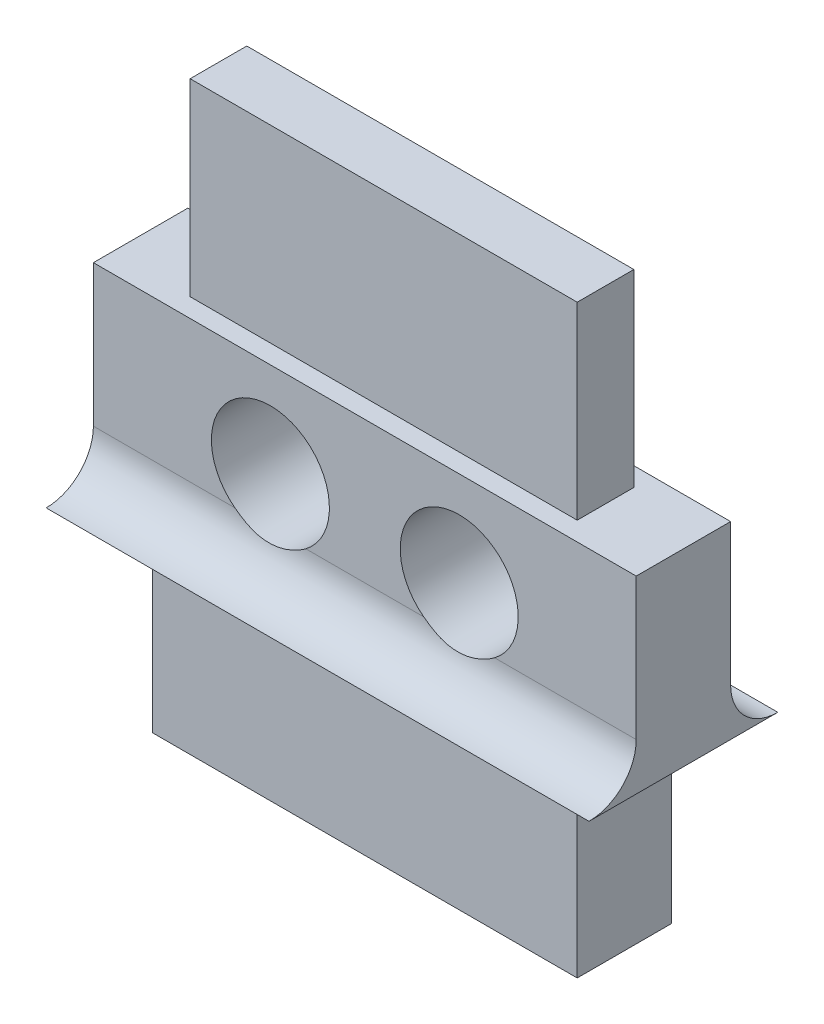
ISO-10303-21;
HEADER;
FILE_DESCRIPTION(('STEP AP214'),'2;1');
FILE_NAME('part.step','',(''),(''),'','','');
FILE_SCHEMA(('AUTOMOTIVE_DESIGN { 1 0 10303 214 1 1 1 1 }'));
ENDSEC;
DATA;
#1=APPLICATION_CONTEXT('core data for automotive mechanical design processes');
#2=APPLICATION_PROTOCOL_DEFINITION('international standard','automotive_design',2000,#1);
#3=PRODUCT_CONTEXT('',#1,'mechanical');
#4=PRODUCT('Part','Part','',(#3));
#5=PRODUCT_RELATED_PRODUCT_CATEGORY('part','',(#4));
#6=PRODUCT_DEFINITION_FORMATION('','',#4);
#7=PRODUCT_DEFINITION_CONTEXT('part definition',#1,'design');
#8=PRODUCT_DEFINITION('design','',#6,#7);
#9=PRODUCT_DEFINITION_SHAPE('','',#8);
#10=(LENGTH_UNIT() NAMED_UNIT(*) SI_UNIT(.MILLI.,.METRE.));
#11=(NAMED_UNIT(*) PLANE_ANGLE_UNIT() SI_UNIT($,.RADIAN.));
#12=(NAMED_UNIT(*) SI_UNIT($,.STERADIAN.) SOLID_ANGLE_UNIT());
#13=UNCERTAINTY_MEASURE_WITH_UNIT(LENGTH_MEASURE(1.E-05),#10,'distance_accuracy_value','');
#14=(GEOMETRIC_REPRESENTATION_CONTEXT(3) GLOBAL_UNCERTAINTY_ASSIGNED_CONTEXT((#13)) GLOBAL_UNIT_ASSIGNED_CONTEXT((#10,
#11,#12)) REPRESENTATION_CONTEXT('',''));
#15=CARTESIAN_POINT('',(0.,0.,0.));
#16=DIRECTION('',(0.,0.,1.));
#17=DIRECTION('',(1.,0.,0.));
#18=AXIS2_PLACEMENT_3D('',#15,#16,#17);
#19=CARTESIAN_POINT('',(0.,0.,0.));
#20=DIRECTION('',(0.,0.,1.));
#21=DIRECTION('',(1.,0.,0.));
#22=AXIS2_PLACEMENT_3D('',#19,#20,#21);
#23=PLANE('',#22);
#24=DIRECTION('',(-1.,0.,0.));
#25=VECTOR('',#24,1.);
#26=CARTESIAN_POINT('',(1.24999999999997,8.00000000000001,0.));
#27=LINE('',#26,#25);
#28=CARTESIAN_POINT('',(11.5007199999999,8.00000000000001,0.));
#29=VERTEX_POINT('',#28);
#30=CARTESIAN_POINT('',(0.,8.00000000000001,0.));
#31=VERTEX_POINT('',#30);
#32=EDGE_CURVE('E301',#29,#31,#27,.T.);
#33=ORIENTED_EDGE('',*,*,#32,.F.);
#34=DIRECTION('',(0.,1.,0.));
#35=VECTOR('',#34,1.);
#36=CARTESIAN_POINT('',(11.5007199999999,8.00000000000001,0.));
#37=LINE('',#36,#35);
#38=CARTESIAN_POINT('',(11.5007199999999,5.,0.));
#39=VERTEX_POINT('',#38);
#40=EDGE_CURVE('E62',#39,#29,#37,.T.);
#41=ORIENTED_EDGE('',*,*,#40,.F.);
#42=DIRECTION('',(-1.,0.,0.));
#43=VECTOR('',#42,1.);
#44=CARTESIAN_POINT('',(12.914933562373,5.,0.));
#45=LINE('',#44,#43);
#46=CARTESIAN_POINT('',(8.50071999999964,5.,0.));
#47=VERTEX_POINT('',#46);
#48=EDGE_CURVE('E236',#39,#47,#45,.T.);
#49=ORIENTED_EDGE('',*,*,#48,.T.);
#50=CARTESIAN_POINT('',(7.75071999999997,6.00000000000023,0.));
#51=DIRECTION('',(0.,0.,1.));
#52=DIRECTION('',(1.,0.,0.));
#53=AXIS2_PLACEMENT_3D('',#50,#51,#52);
#54=CIRCLE('',#53,1.24999999999998);
#55=CARTESIAN_POINT('',(7.00072000000032,5.,0.));
#56=VERTEX_POINT('',#55);
#57=EDGE_CURVE('E267',#47,#56,#54,.T.);
#58=ORIENTED_EDGE('',*,*,#57,.T.);
#59=CARTESIAN_POINT('',(4.49999999999962,5.,0.));
#60=VERTEX_POINT('',#59);
#61=EDGE_CURVE('E241',#56,#60,#45,.T.);
#62=ORIENTED_EDGE('',*,*,#61,.T.);
#63=CARTESIAN_POINT('',(3.74999999999997,6.00000000000023,0.));
#64=DIRECTION('',(0.,0.,1.));
#65=DIRECTION('',(1.,0.,0.));
#66=AXIS2_PLACEMENT_3D('',#63,#64,#65);
#67=CIRCLE('',#66,1.24999999999997);
#68=CARTESIAN_POINT('',(3.00000000000032,5.,0.));
#69=VERTEX_POINT('',#68);
#70=EDGE_CURVE('E263',#60,#69,#67,.T.);
#71=ORIENTED_EDGE('',*,*,#70,.T.);
#72=CARTESIAN_POINT('',(0.,5.,0.));
#73=VERTEX_POINT('',#72);
#74=EDGE_CURVE('E242',#69,#73,#45,.T.);
#75=ORIENTED_EDGE('',*,*,#74,.T.);
#76=DIRECTION('',(0.,-1.,0.));
#77=VECTOR('',#76,1.);
#78=CARTESIAN_POINT('',(0.,8.00000000000001,0.));
#79=LINE('',#78,#77);
#80=EDGE_CURVE('E280',#31,#73,#79,.T.);
#81=ORIENTED_EDGE('',*,*,#80,.F.);
#82=EDGE_LOOP('',(#33,#41,#49,#58,#62,#71,#75,#81));
#83=FACE_BOUND('',#82,.T.);
#84=ADVANCED_FACE('F34',(#83),#23,.F.);
#85=CARTESIAN_POINT('',(0.,0.,2.));
#86=DIRECTION('',(0.,0.,1.));
#87=DIRECTION('',(1.,0.,0.));
#88=AXIS2_PLACEMENT_3D('',#85,#86,#87);
#89=PLANE('',#88);
#90=DIRECTION('',(-1.,0.,0.));
#91=VECTOR('',#90,1.);
#92=CARTESIAN_POINT('',(10.25072,8.00000000000001,2.));
#93=LINE('',#92,#91);
#94=CARTESIAN_POINT('',(11.5007199999999,8.00000000000001,2.));
#95=VERTEX_POINT('',#94);
#96=CARTESIAN_POINT('',(0.,8.00000000000001,2.));
#97=VERTEX_POINT('',#96);
#98=EDGE_CURVE('E287',#95,#97,#93,.T.);
#99=ORIENTED_EDGE('',*,*,#98,.T.);
#100=DIRECTION('',(0.,-1.,0.));
#101=VECTOR('',#100,1.);
#102=CARTESIAN_POINT('',(0.,8.00000000000001,2.));
#103=LINE('',#102,#101);
#104=CARTESIAN_POINT('',(0.,5.,2.));
#105=VERTEX_POINT('',#104);
#106=EDGE_CURVE('E289',#97,#105,#103,.T.);
#107=ORIENTED_EDGE('',*,*,#106,.T.);
#108=DIRECTION('',(-1.,0.,0.));
#109=VECTOR('',#108,1.);
#110=CARTESIAN_POINT('',(12.914933562373,5.,2.));
#111=LINE('',#110,#109);
#112=CARTESIAN_POINT('',(3.00000000000032,5.,2.));
#113=VERTEX_POINT('',#112);
#114=EDGE_CURVE('E258',#113,#105,#111,.T.);
#115=ORIENTED_EDGE('',*,*,#114,.F.);
#116=CARTESIAN_POINT('',(3.74999999999997,6.00000000000023,2.));
#117=DIRECTION('',(0.,0.,1.));
#118=DIRECTION('',(1.,0.,0.));
#119=AXIS2_PLACEMENT_3D('',#116,#117,#118);
#120=CIRCLE('',#119,1.24999999999997);
#121=CARTESIAN_POINT('',(4.49999999999962,5.,2.));
#122=VERTEX_POINT('',#121);
#123=EDGE_CURVE('E264',#122,#113,#120,.T.);
#124=ORIENTED_EDGE('',*,*,#123,.F.);
#125=CARTESIAN_POINT('',(7.00072000000031,5.,2.));
#126=VERTEX_POINT('',#125);
#127=EDGE_CURVE('E257',#126,#122,#111,.T.);
#128=ORIENTED_EDGE('',*,*,#127,.F.);
#129=CARTESIAN_POINT('',(7.75071999999997,6.00000000000023,2.));
#130=DIRECTION('',(0.,0.,1.));
#131=DIRECTION('',(1.,0.,0.));
#132=AXIS2_PLACEMENT_3D('',#129,#130,#131);
#133=CIRCLE('',#132,1.24999999999998);
#134=CARTESIAN_POINT('',(8.50071999999963,5.,2.));
#135=VERTEX_POINT('',#134);
#136=EDGE_CURVE('E270',#135,#126,#133,.T.);
#137=ORIENTED_EDGE('',*,*,#136,.F.);
#138=CARTESIAN_POINT('',(11.5007199999999,5.,2.));
#139=VERTEX_POINT('',#138);
#140=EDGE_CURVE('E254',#139,#135,#111,.T.);
#141=ORIENTED_EDGE('',*,*,#140,.F.);
#142=DIRECTION('',(0.,1.,0.));
#143=VECTOR('',#142,1.);
#144=CARTESIAN_POINT('',(11.5007199999999,8.00000000000001,2.));
#145=LINE('',#144,#143);
#146=EDGE_CURVE('E285',#139,#95,#145,.T.);
#147=ORIENTED_EDGE('',*,*,#146,.T.);
#148=EDGE_LOOP('',(#99,#107,#115,#124,#128,#137,#141,#147));
#149=FACE_BOUND('',#148,.T.);
#150=ADVANCED_FACE('F343',(#149),#89,.T.);
#151=DIRECTION('',(-1.,0.,0.));
#152=VECTOR('',#151,1.);
#153=CARTESIAN_POINT('',(12.914933562373,4.,2.));
#154=LINE('',#153,#152);
#155=CARTESIAN_POINT('',(10.25072,4.,2.));
#156=VERTEX_POINT('',#155);
#157=CARTESIAN_POINT('',(1.24999999999997,4.,2.));
#158=VERTEX_POINT('',#157);
#159=EDGE_CURVE('E251',#156,#158,#154,.T.);
#160=ORIENTED_EDGE('',*,*,#159,.T.);
#161=DIRECTION('',(0.,-1.,0.));
#162=VECTOR('',#161,1.);
#163=CARTESIAN_POINT('',(1.24999999999997,4.,2.));
#164=LINE('',#163,#162);
#165=CARTESIAN_POINT('',(1.24999999999997,0.,2.));
#166=VERTEX_POINT('',#165);
#167=EDGE_CURVE('E276',#158,#166,#164,.T.);
#168=ORIENTED_EDGE('',*,*,#167,.T.);
#169=DIRECTION('',(1.,0.,0.));
#170=VECTOR('',#169,1.);
#171=CARTESIAN_POINT('',(1.24999999999997,0.,2.));
#172=LINE('',#171,#170);
#173=CARTESIAN_POINT('',(10.25072,0.,2.));
#174=VERTEX_POINT('',#173);
#175=EDGE_CURVE('E279',#166,#174,#172,.T.);
#176=ORIENTED_EDGE('',*,*,#175,.T.);
#177=DIRECTION('',(0.,1.,0.));
#178=VECTOR('',#177,1.);
#179=CARTESIAN_POINT('',(10.25072,4.,2.));
#180=LINE('',#179,#178);
#181=EDGE_CURVE('E282',#174,#156,#180,.T.);
#182=ORIENTED_EDGE('',*,*,#181,.T.);
#183=EDGE_LOOP('',(#160,#168,#176,#182));
#184=FACE_BOUND('',#183,.T.);
#185=ADVANCED_FACE('F341',(#184),#89,.T.);
#186=DIRECTION('',(0.,-1.,0.));
#187=VECTOR('',#186,1.);
#188=CARTESIAN_POINT('',(1.24999999999997,4.,0.));
#189=LINE('',#188,#187);
#190=CARTESIAN_POINT('',(1.24999999999997,4.,0.));
#191=VERTEX_POINT('',#190);
#192=CARTESIAN_POINT('',(1.24999999999997,0.,0.));
#193=VERTEX_POINT('',#192);
#194=EDGE_CURVE('E273',#191,#193,#189,.T.);
#195=ORIENTED_EDGE('',*,*,#194,.F.);
#196=DIRECTION('',(-1.,0.,0.));
#197=VECTOR('',#196,1.);
#198=CARTESIAN_POINT('',(12.914933562373,4.,0.));
#199=LINE('',#198,#197);
#200=CARTESIAN_POINT('',(10.25072,4.,0.));
#201=VERTEX_POINT('',#200);
#202=EDGE_CURVE('E243',#201,#191,#199,.T.);
#203=ORIENTED_EDGE('',*,*,#202,.F.);
#204=DIRECTION('',(0.,1.,0.));
#205=VECTOR('',#204,1.);
#206=CARTESIAN_POINT('',(10.25072,4.,0.));
#207=LINE('',#206,#205);
#208=CARTESIAN_POINT('',(10.25072,0.,0.));
#209=VERTEX_POINT('',#208);
#210=EDGE_CURVE('E297',#209,#201,#207,.T.);
#211=ORIENTED_EDGE('',*,*,#210,.F.);
#212=DIRECTION('',(1.,0.,0.));
#213=VECTOR('',#212,1.);
#214=CARTESIAN_POINT('',(1.24999999999997,0.,0.));
#215=LINE('',#214,#213);
#216=EDGE_CURVE('E295',#193,#209,#215,.T.);
#217=ORIENTED_EDGE('',*,*,#216,.F.);
#218=EDGE_LOOP('',(#195,#203,#211,#217));
#219=FACE_BOUND('',#218,.T.);
#220=ADVANCED_FACE('F331',(#219),#23,.F.);
#221=CARTESIAN_POINT('',(1.24999999999997,4.,2.));
#222=DIRECTION('',(1.,0.,0.));
#223=DIRECTION('',(0.,1.,0.));
#224=AXIS2_PLACEMENT_3D('',#221,#222,#223);
#225=PLANE('',#224);
#226=ORIENTED_EDGE('',*,*,#194,.T.);
#227=DIRECTION('',(0.,0.,-1.));
#228=VECTOR('',#227,1.);
#229=CARTESIAN_POINT('',(1.24999999999997,0.,2.));
#230=LINE('',#229,#228);
#231=EDGE_CURVE('E47',#166,#193,#230,.T.);
#232=ORIENTED_EDGE('',*,*,#231,.F.);
#233=ORIENTED_EDGE('',*,*,#167,.F.);
#234=DIRECTION('',(0.,0.,-1.));
#235=VECTOR('',#234,1.);
#236=CARTESIAN_POINT('',(1.24999999999997,4.,2.));
#237=LINE('',#236,#235);
#238=EDGE_CURVE('E292',#158,#191,#237,.T.);
#239=ORIENTED_EDGE('',*,*,#238,.T.);
#240=EDGE_LOOP('',(#226,#232,#233,#239));
#241=FACE_BOUND('',#240,.T.);
#242=ADVANCED_FACE('F36',(#241),#225,.F.);
#243=CARTESIAN_POINT('',(1.24999999999997,0.,2.));
#244=DIRECTION('',(0.,1.,0.));
#245=DIRECTION('',(-1.,0.,0.));
#246=AXIS2_PLACEMENT_3D('',#243,#244,#245);
#247=PLANE('',#246);
#248=ORIENTED_EDGE('',*,*,#216,.T.);
#249=DIRECTION('',(0.,0.,-1.));
#250=VECTOR('',#249,1.);
#251=CARTESIAN_POINT('',(10.25072,0.,2.));
#252=LINE('',#251,#250);
#253=EDGE_CURVE('E319',#174,#209,#252,.T.);
#254=ORIENTED_EDGE('',*,*,#253,.F.);
#255=ORIENTED_EDGE('',*,*,#175,.F.);
#256=ORIENTED_EDGE('',*,*,#231,.T.);
#257=EDGE_LOOP('',(#248,#254,#255,#256));
#258=FACE_BOUND('',#257,.T.);
#259=ADVANCED_FACE('F324',(#258),#247,.F.);
#260=CARTESIAN_POINT('',(10.25072,4.,2.));
#261=DIRECTION('',(-1.,0.,0.));
#262=DIRECTION('',(0.,-1.,0.));
#263=AXIS2_PLACEMENT_3D('',#260,#261,#262);
#264=PLANE('',#263);
#265=ORIENTED_EDGE('',*,*,#210,.T.);
#266=DIRECTION('',(0.,0.,-1.));
#267=VECTOR('',#266,1.);
#268=CARTESIAN_POINT('',(10.25072,4.,2.));
#269=LINE('',#268,#267);
#270=EDGE_CURVE('E316',#156,#201,#269,.T.);
#271=ORIENTED_EDGE('',*,*,#270,.F.);
#272=ORIENTED_EDGE('',*,*,#181,.F.);
#273=ORIENTED_EDGE('',*,*,#253,.T.);
#274=EDGE_LOOP('',(#265,#271,#272,#273));
#275=FACE_BOUND('',#274,.T.);
#276=ADVANCED_FACE('F339',(#275),#264,.F.);
#277=CARTESIAN_POINT('',(11.5007199999999,8.00000000000001,2.));
#278=DIRECTION('',(-1.,0.,0.));
#279=DIRECTION('',(0.,0.,1.));
#280=AXIS2_PLACEMENT_3D('',#277,#278,#279);
#281=PLANE('',#280);
#282=DIRECTION('',(0.,0.,-1.));
#283=VECTOR('',#282,1.);
#284=CARTESIAN_POINT('',(11.5007199999999,4.,2.));
#285=LINE('',#284,#283);
#286=CARTESIAN_POINT('',(11.5007199999999,4.,3.));
#287=VERTEX_POINT('',#286);
#288=CARTESIAN_POINT('',(11.5007199999999,4.,-1.));
#289=VERTEX_POINT('',#288);
#290=EDGE_CURVE('E314',#287,#289,#285,.T.);
#291=ORIENTED_EDGE('',*,*,#290,.T.);
#292=CARTESIAN_POINT('',(11.5007199999999,5.,-1.));
#293=DIRECTION('',(-1.,0.,0.));
#294=DIRECTION('',(0.,0.,1.));
#295=AXIS2_PLACEMENT_3D('',#292,#293,#294);
#296=CIRCLE('',#295,1.);
#297=EDGE_CURVE('E233',#289,#39,#296,.T.);
#298=ORIENTED_EDGE('',*,*,#297,.T.);
#299=ORIENTED_EDGE('',*,*,#40,.T.);
#300=DIRECTION('',(0.,0.,-1.));
#301=VECTOR('',#300,1.);
#302=CARTESIAN_POINT('',(11.5007199999999,8.00000000000001,2.));
#303=LINE('',#302,#301);
#304=EDGE_CURVE('E311',#95,#29,#303,.T.);
#305=ORIENTED_EDGE('',*,*,#304,.F.);
#306=ORIENTED_EDGE('',*,*,#146,.F.);
#307=CARTESIAN_POINT('',(11.5007199999999,5.,3.));
#308=DIRECTION('',(-1.,0.,0.));
#309=DIRECTION('',(0.,0.,1.));
#310=AXIS2_PLACEMENT_3D('',#307,#308,#309);
#311=CIRCLE('',#310,1.);
#312=EDGE_CURVE('E253',#139,#287,#311,.T.);
#313=ORIENTED_EDGE('',*,*,#312,.T.);
#314=EDGE_LOOP('',(#291,#298,#299,#305,#306,#313));
#315=FACE_BOUND('',#314,.T.);
#316=ADVANCED_FACE('F367',(#315),#281,.F.);
#317=CARTESIAN_POINT('',(1.24999999999997,8.00000000000001,2.));
#318=DIRECTION('',(0.,-1.,0.));
#319=DIRECTION('',(0.,0.,-1.));
#320=AXIS2_PLACEMENT_3D('',#317,#318,#319);
#321=PLANE('',#320);
#322=ORIENTED_EDGE('',*,*,#32,.T.);
#323=DIRECTION('',(0.,0.,-1.));
#324=VECTOR('',#323,1.);
#325=CARTESIAN_POINT('',(0.,8.00000000000001,2.));
#326=LINE('',#325,#324);
#327=EDGE_CURVE('E308',#97,#31,#326,.T.);
#328=ORIENTED_EDGE('',*,*,#327,.F.);
#329=ORIENTED_EDGE('',*,*,#98,.F.);
#330=ORIENTED_EDGE('',*,*,#304,.T.);
#331=EDGE_LOOP('',(#322,#328,#329,#330));
#332=FACE_BOUND('',#331,.T.);
#333=DIRECTION('',(0.,0.,-1.));
#334=VECTOR('',#333,1.);
#335=CARTESIAN_POINT('',(9.85071999999997,8.00000000000001,0.4));
#336=LINE('',#335,#334);
#337=CARTESIAN_POINT('',(9.85071999999997,8.00000000000001,1.6));
#338=VERTEX_POINT('',#337);
#339=CARTESIAN_POINT('',(9.85071999999997,8.00000000000001,0.4));
#340=VERTEX_POINT('',#339);
#341=EDGE_CURVE('E182',#338,#340,#336,.T.);
#342=ORIENTED_EDGE('',*,*,#341,.F.);
#343=DIRECTION('',(1.,0.,0.));
#344=VECTOR('',#343,1.);
#345=CARTESIAN_POINT('',(9.85071999999997,8.00000000000001,1.6));
#346=LINE('',#345,#344);
#347=CARTESIAN_POINT('',(1.64999999999997,8.00000000000001,1.6));
#348=VERTEX_POINT('',#347);
#349=EDGE_CURVE('E176',#348,#338,#346,.T.);
#350=ORIENTED_EDGE('',*,*,#349,.F.);
#351=DIRECTION('',(0.,0.,1.));
#352=VECTOR('',#351,1.);
#353=CARTESIAN_POINT('',(1.64999999999997,8.00000000000001,0.400000000000001));
#354=LINE('',#353,#352);
#355=CARTESIAN_POINT('',(1.64999999999997,8.00000000000001,0.400000000000001));
#356=VERTEX_POINT('',#355);
#357=EDGE_CURVE('E185',#356,#348,#354,.T.);
#358=ORIENTED_EDGE('',*,*,#357,.F.);
#359=DIRECTION('',(-1.,0.,0.));
#360=VECTOR('',#359,1.);
#361=CARTESIAN_POINT('',(9.85071999999997,8.00000000000001,0.4));
#362=LINE('',#361,#360);
#363=EDGE_CURVE('E168',#340,#356,#362,.T.);
#364=ORIENTED_EDGE('',*,*,#363,.F.);
#365=EDGE_LOOP('',(#342,#350,#358,#364));
#366=FACE_BOUND('',#365,.T.);
#367=ADVANCED_FACE('F180',(#332,#366),#321,.F.);
#368=CARTESIAN_POINT('',(0.,8.00000000000001,2.));
#369=DIRECTION('',(1.,0.,0.));
#370=DIRECTION('',(0.,1.,0.));
#371=AXIS2_PLACEMENT_3D('',#368,#369,#370);
#372=PLANE('',#371);
#373=ORIENTED_EDGE('',*,*,#80,.T.);
#374=CARTESIAN_POINT('',(0.,5.,-1.));
#375=DIRECTION('',(1.,0.,0.));
#376=DIRECTION('',(0.,1.,0.));
#377=AXIS2_PLACEMENT_3D('',#374,#375,#376);
#378=CIRCLE('',#377,1.);
#379=CARTESIAN_POINT('',(0.,4.,-1.));
#380=VERTEX_POINT('',#379);
#381=EDGE_CURVE('E232',#73,#380,#378,.T.);
#382=ORIENTED_EDGE('',*,*,#381,.T.);
#383=DIRECTION('',(0.,0.,-1.));
#384=VECTOR('',#383,1.);
#385=CARTESIAN_POINT('',(0.,4.,2.));
#386=LINE('',#385,#384);
#387=CARTESIAN_POINT('',(0.,4.,3.));
#388=VERTEX_POINT('',#387);
#389=EDGE_CURVE('E306',#388,#380,#386,.T.);
#390=ORIENTED_EDGE('',*,*,#389,.F.);
#391=CARTESIAN_POINT('',(0.,5.,3.));
#392=DIRECTION('',(1.,0.,0.));
#393=DIRECTION('',(0.,-1.,0.));
#394=AXIS2_PLACEMENT_3D('',#391,#392,#393);
#395=CIRCLE('',#394,1.);
#396=EDGE_CURVE('E235',#388,#105,#395,.T.);
#397=ORIENTED_EDGE('',*,*,#396,.T.);
#398=ORIENTED_EDGE('',*,*,#106,.F.);
#399=ORIENTED_EDGE('',*,*,#327,.T.);
#400=EDGE_LOOP('',(#373,#382,#390,#397,#398,#399));
#401=FACE_BOUND('',#400,.T.);
#402=ADVANCED_FACE('F361',(#401),#372,.F.);
#403=CARTESIAN_POINT('',(1.24999999999997,4.,2.));
#404=DIRECTION('',(0.,1.,0.));
#405=DIRECTION('',(0.,0.,1.));
#406=AXIS2_PLACEMENT_3D('',#403,#404,#405);
#407=PLANE('',#406);
#408=ORIENTED_EDGE('',*,*,#202,.T.);
#409=ORIENTED_EDGE('',*,*,#238,.F.);
#410=ORIENTED_EDGE('',*,*,#159,.F.);
#411=ORIENTED_EDGE('',*,*,#270,.T.);
#412=EDGE_LOOP('',(#408,#409,#410,#411));
#413=FACE_BOUND('',#412,.T.);
#414=ORIENTED_EDGE('',*,*,#389,.T.);
#415=DIRECTION('',(-1.,0.,0.));
#416=VECTOR('',#415,1.);
#417=CARTESIAN_POINT('',(12.914933562373,4.,-1.));
#418=LINE('',#417,#416);
#419=EDGE_CURVE('E239',#289,#380,#418,.T.);
#420=ORIENTED_EDGE('',*,*,#419,.F.);
#421=ORIENTED_EDGE('',*,*,#290,.F.);
#422=DIRECTION('',(-1.,0.,0.));
#423=VECTOR('',#422,1.);
#424=CARTESIAN_POINT('',(12.914933562373,4.,3.));
#425=LINE('',#424,#423);
#426=EDGE_CURVE('E250',#287,#388,#425,.T.);
#427=ORIENTED_EDGE('',*,*,#426,.T.);
#428=EDGE_LOOP('',(#414,#420,#421,#427));
#429=FACE_BOUND('',#428,.T.);
#430=ADVANCED_FACE('F334',(#413,#429),#407,.F.);
#431=CARTESIAN_POINT('',(7.75071999999997,6.00000000000023,2.));
#432=DIRECTION('',(0.,0.,-1.));
#433=DIRECTION('',(-1.,0.,0.));
#434=AXIS2_PLACEMENT_3D('',#431,#432,#433);
#435=CYLINDRICAL_SURFACE('',#434,1.24999999999998);
#436=ORIENTED_EDGE('',*,*,#136,.T.);
#437=CARTESIAN_POINT('',(6.50072,6.,3.));
#438=CARTESIAN_POINT('',(6.50072532169146,5.99999978361962,2.97204992704358));
#439=CARTESIAN_POINT('',(6.50071939610446,5.99882745440819,2.9441131972668));
#440=CARTESIAN_POINT('',(6.50073046598745,5.99415030073656,2.88843631015914));
#441=CARTESIAN_POINT('',(6.50074746097995,5.99064552486542,2.86069614874554));
#442=CARTESIAN_POINT('',(6.50090094022251,5.97665054069726,2.77802649176053));
#443=CARTESIAN_POINT('',(6.50113990971723,5.96267967333993,2.72364483905864));
#444=CARTESIAN_POINT('',(6.50278662214765,5.92584624654431,2.61797088191552));
#445=CARTESIAN_POINT('',(6.50419535772504,5.90297614414265,2.5666812409598));
#446=CARTESIAN_POINT('',(6.50957283886306,5.84905409519246,2.46875147393668));
#447=CARTESIAN_POINT('',(6.51353998426913,5.81800726994184,2.422108462677));
#448=CARTESIAN_POINT('',(6.52554707147617,5.74976709316367,2.33608412192638));
#449=CARTESIAN_POINT('',(6.53347946503019,5.71275267904168,2.2965466821992));
#450=CARTESIAN_POINT('',(6.55488696571303,5.6337368256466,2.2246138986495));
#451=CARTESIAN_POINT('',(6.5683566501472,5.59174029392989,2.19221161487647));
#452=CARTESIAN_POINT('',(6.60033915577241,5.50919134506977,2.13806611689877));
#453=CARTESIAN_POINT('',(6.61825588390264,5.46887683924685,2.11560544227966));
#454=CARTESIAN_POINT('',(6.65980351938817,5.38806641572971,2.07728408580201));
#455=CARTESIAN_POINT('',(6.68343424400287,5.34757050387771,2.0614231929185));
#456=CARTESIAN_POINT('',(6.73523659665331,5.2696514541779,2.03619966154708));
#457=CARTESIAN_POINT('',(6.76322393193426,5.23217052849071,2.02663214527757));
#458=CARTESIAN_POINT('',(6.82374194947047,5.16010161782889,2.0122144777549));
#459=CARTESIAN_POINT('',(6.856274290725,5.12551469661602,2.00736605421709));
#460=CARTESIAN_POINT('',(6.92945872859267,5.05613898673155,2.0008963891932));
#461=CARTESIAN_POINT('',(6.9706172919172,5.02184368283418,1.99974280360213));
#462=CARTESIAN_POINT('',(7.05697101598225,4.95880959112038,2.00035077178162));
#463=CARTESIAN_POINT('',(7.10216939804423,4.93007529644919,2.00211467190863));
#464=CARTESIAN_POINT('',(7.20524370870765,4.87346978488139,2.00755027815467));
#465=CARTESIAN_POINT('',(7.26384075093854,4.84693522897629,2.01153441073528));
#466=CARTESIAN_POINT('',(7.38442418322838,4.80315151527515,2.01931330599981));
#467=CARTESIAN_POINT('',(7.44641164051076,4.78590529997748,2.02310800832818));
#468=CARTESIAN_POINT('',(7.57842588452386,4.75993775182277,2.02913832605215));
#469=CARTESIAN_POINT('',(7.64865574404498,4.75218578355409,2.03119083642386));
#470=CARTESIAN_POINT('',(7.78942421870189,4.74861724429449,2.03211032718628));
#471=CARTESIAN_POINT('',(7.8599627717348,4.7527983737185,2.03097792133153));
#472=CARTESIAN_POINT('',(7.99719495889271,4.77263724561326,2.02614044681261));
#473=CARTESIAN_POINT('',(8.063940750725,4.78795762791373,2.02251116782302));
#474=CARTESIAN_POINT('',(8.19406539328195,4.82926926560037,2.0144593500494));
#475=CARTESIAN_POINT('',(8.25744046850784,4.85527221346863,2.0100359450599));
#476=CARTESIAN_POINT('',(8.38102967718007,4.91825821224949,2.0028273129751));
#477=CARTESIAN_POINT('',(8.44109165479262,4.9555476557265,2.00009529153889));
#478=CARTESIAN_POINT('',(8.55403621794822,5.0397337462953,1.99991026215672));
#479=CARTESIAN_POINT('',(8.60693400316511,5.08660950679127,2.00244588528641));
#480=CARTESIAN_POINT('',(8.69017928767852,5.17387180734177,2.01453855024301));
#481=CARTESIAN_POINT('',(8.72271722033839,5.212467219141,2.02195960479528));
#482=CARTESIAN_POINT('',(8.78224679651315,5.29224299954566,2.0427710050816));
#483=CARTESIAN_POINT('',(8.80924376580793,5.33342083582994,2.05615557927127));
#484=CARTESIAN_POINT('',(8.85733112585975,5.41670278630373,2.08984480805756));
#485=CARTESIAN_POINT('',(8.8783937406162,5.4588102931143,2.11018104988533));
#486=CARTESIAN_POINT('',(8.91449184072981,5.54155119806155,2.15797690000796));
#487=CARTESIAN_POINT('',(8.92952668708271,5.58218443949619,2.18543726302353));
#488=CARTESIAN_POINT('',(8.95335054186465,5.65704979983648,2.24475039840749));
#489=CARTESIAN_POINT('',(8.96251286282049,5.69153236049709,2.27614137822856));
#490=CARTESIAN_POINT('',(8.9771443623878,5.75611198943674,2.34388549282698));
#491=CARTESIAN_POINT('',(8.9826129359274,5.78620833857858,2.38023943941481));
#492=CARTESIAN_POINT('',(8.99112313416134,5.84263813582409,2.45921483165553));
#493=CARTESIAN_POINT('',(8.99400887923185,5.86865984337178,2.50207525475577));
#494=CARTESIAN_POINT('',(8.99796868948614,5.91403249458111,2.59127815841558));
#495=CARTESIAN_POINT('',(8.99904163383959,5.93337930536606,2.63762277472509));
#496=CARTESIAN_POINT('',(9.00037107652992,5.96595332765261,2.73584249898936));
#497=CARTESIAN_POINT('',(9.00056947887205,5.97869656184542,2.78788101534216));
#498=CARTESIAN_POINT('',(9.00069708521,5.99146460992094,2.8669085241022));
#499=CARTESIAN_POINT('',(9.00071126209137,5.99466283273372,2.89342243079684));
#500=CARTESIAN_POINT('',(9.00072052862289,5.99893031356652,2.94662017774424));
#501=CARTESIAN_POINT('',(9.00071561890911,5.99999964253087,2.97330401230451));
#502=CARTESIAN_POINT('',(9.00071999999995,6.,3.));
#503=B_SPLINE_CURVE_WITH_KNOTS('',3,(#437,#438,#439,#440,#441,#442,#443,#444,#445,#446,#447,
#448,#449,#450,#451,#452,#453,#454,#455,#456,#457,#458,#459,#460,#461,#462,#463,#464,#465,#466,
#467,#468,#469,#470,#471,#472,#473,#474,#475,#476,#477,#478,#479,#480,#481,#482,#483,#484,#485,
#486,#487,#488,#489,#490,#491,#492,#493,#494,#495,#496,#497,#498,#499,#500,#501,#502),
.UNSPECIFIED.,.F.,.F.,(4,2,2,2,2,2,2,2,2,2,2,2,2,2,2,2,2,2,2,2,2,2,2,2,2,2,2,2,2,2,2,2,4),(0.,
0.0837991264591867,0.167596507286032,0.335182428328774,0.502910705164787,0.670534178146347,
0.83383965075248,0.996985577091702,1.1447307915601,1.2924712815802,1.4351265755665,
1.57783407771075,1.73800933032284,1.898313464803,2.09086826397854,2.2834840276932,
2.49446115488416,2.70539762816395,2.91019854784175,3.11522422983577,3.32640921793773,
3.53713888837388,3.6895840208512,3.84188193504676,3.99488127288407,4.14789682590834,
4.2898369515479,4.43180032273025,4.58184518650066,4.73198278709179,4.89195684490057,
4.97200189248414,5.05204427256112),.UNSPECIFIED.);
#504=EDGE_CURVE('E201',#126,#135,#503,.T.);
#505=ORIENTED_EDGE('',*,*,#504,.T.);
#506=EDGE_LOOP('',(#436,#505));
#507=FACE_BOUND('',#506,.T.);
#508=ORIENTED_EDGE('',*,*,#57,.F.);
#509=CARTESIAN_POINT('',(9.00071999999995,6.00000000000023,-1.));
#510=CARTESIAN_POINT('',(9.0007146783085,5.9999997836197,-0.972049927043585));
#511=CARTESIAN_POINT('',(9.00072060389549,5.99882745440822,-0.944113197266816));
#512=CARTESIAN_POINT('',(9.00070953401251,5.99415030073654,-0.888436310159157));
#513=CARTESIAN_POINT('',(9.00069253902,5.99064552486541,-0.860696148745559));
#514=CARTESIAN_POINT('',(9.00053905977744,5.97665054069728,-0.778026491760542));
#515=CARTESIAN_POINT('',(9.00030009028272,5.96267967333993,-0.723644839058651));
#516=CARTESIAN_POINT('',(8.99865337785231,5.92584624654431,-0.617970881915522));
#517=CARTESIAN_POINT('',(8.99724464227491,5.90297614414265,-0.566681240959797));
#518=CARTESIAN_POINT('',(8.99186716113689,5.84905409519246,-0.46875147393668));
#519=CARTESIAN_POINT('',(8.98790001573082,5.81800726994184,-0.422108462677004));
#520=CARTESIAN_POINT('',(8.97589292852379,5.74976709316367,-0.336084121926386));
#521=CARTESIAN_POINT('',(8.96796053496976,5.71275267904169,-0.296546682199207));
#522=CARTESIAN_POINT('',(8.94655303428693,5.6337368256466,-0.2246138986495));
#523=CARTESIAN_POINT('',(8.93308334985275,5.5917402939299,-0.192211614876471));
#524=CARTESIAN_POINT('',(8.90110084422754,5.50919134506978,-0.138066116898775));
#525=CARTESIAN_POINT('',(8.88318411609732,5.46887683924686,-0.115605442279658));
#526=CARTESIAN_POINT('',(8.84163648061178,5.38806641572971,-0.0772840858020151));
#527=CARTESIAN_POINT('',(8.81800575599709,5.34757050387772,-0.0614231929185052));
#528=CARTESIAN_POINT('',(8.76620340334664,5.26965145417791,-0.0361996615470828));
#529=CARTESIAN_POINT('',(8.7382160680657,5.23217052849072,-0.0266321452775715));
#530=CARTESIAN_POINT('',(8.67769805052948,5.16010161782889,-0.0122144777548965));
#531=CARTESIAN_POINT('',(8.64516570927496,5.12551469661603,-0.00736605421709508));
#532=CARTESIAN_POINT('',(8.57198127140729,5.05613898673155,-0.000896389193199293));
#533=CARTESIAN_POINT('',(8.53082270808275,5.02184368283418,0.000257196397874055));
#534=CARTESIAN_POINT('',(8.4444689840177,4.95880959112039,-0.000350771781617829));
#535=CARTESIAN_POINT('',(8.39927060195573,4.9300752964492,-0.00211467190862638));
#536=CARTESIAN_POINT('',(8.29619629129231,4.87346978488139,-0.00755027815466965));
#537=CARTESIAN_POINT('',(8.23759924906142,4.84693522897629,-0.0115344107352799));
#538=CARTESIAN_POINT('',(8.11701581677158,4.80315151527515,-0.0193133059998094));
#539=CARTESIAN_POINT('',(8.05502835948919,4.78590529997748,-0.0231080083281837));
#540=CARTESIAN_POINT('',(7.9230141154761,4.75993775182277,-0.0291383260521484));
#541=CARTESIAN_POINT('',(7.85278425595498,4.75218578355409,-0.0311908364238647));
#542=CARTESIAN_POINT('',(7.71201578129807,4.74861724429449,-0.032110327186275));
#543=CARTESIAN_POINT('',(7.64147722826516,4.7527983737185,-0.0309779213315299));
#544=CARTESIAN_POINT('',(7.50424504110725,4.77263724561326,-0.0261404468126092));
#545=CARTESIAN_POINT('',(7.43749924927496,4.78795762791373,-0.0225111678230187));
#546=CARTESIAN_POINT('',(7.30737460671801,4.82926926560037,-0.0144593500494017));
#547=CARTESIAN_POINT('',(7.24399953149211,4.85527221346863,-0.0100359450599042));
#548=CARTESIAN_POINT('',(7.12041032281989,4.91825821224948,-0.00282731297510131));
#549=CARTESIAN_POINT('',(7.06034834520733,4.9555476557265,-9.52915388884311E-05));
#550=CARTESIAN_POINT('',(6.94740378205173,5.0397337462953,8.973784328037E-05));
#551=CARTESIAN_POINT('',(6.89450599683485,5.08660950679127,-0.00244588528641195));
#552=CARTESIAN_POINT('',(6.81126071232144,5.17387180734177,-0.0145385502430097));
#553=CARTESIAN_POINT('',(6.77872277966157,5.212467219141,-0.0219596047952745));
#554=CARTESIAN_POINT('',(6.7191932034868,5.29224299954566,-0.0427710050815939));
#555=CARTESIAN_POINT('',(6.69219623419203,5.33342083582994,-0.0561555792712712));
#556=CARTESIAN_POINT('',(6.64410887414021,5.41670278630373,-0.0898448080575548));
#557=CARTESIAN_POINT('',(6.62304625938375,5.45881029311429,-0.110181049885329));
#558=CARTESIAN_POINT('',(6.58694815927015,5.54155119806154,-0.157976900007953));
#559=CARTESIAN_POINT('',(6.57191331291724,5.58218443949618,-0.185437263023527));
#560=CARTESIAN_POINT('',(6.5480894581353,5.65704979983647,-0.244750398407487));
#561=CARTESIAN_POINT('',(6.53892713717947,5.69153236049709,-0.276141378228559));
#562=CARTESIAN_POINT('',(6.52429563761215,5.75611198943674,-0.343885492826977));
#563=CARTESIAN_POINT('',(6.51882706407255,5.78620833857857,-0.38023943941481));
#564=CARTESIAN_POINT('',(6.51031686583861,5.84263813582409,-0.459214831655522));
#565=CARTESIAN_POINT('',(6.50743112076811,5.86865984337177,-0.502075254755766));
#566=CARTESIAN_POINT('',(6.50347131051381,5.91403249458111,-0.591278158415578));
#567=CARTESIAN_POINT('',(6.50239836616036,5.93337930536606,-0.637622774725083));
#568=CARTESIAN_POINT('',(6.50106892347003,5.96595332765261,-0.735842498989359));
#569=CARTESIAN_POINT('',(6.50087052112791,5.97869656184542,-0.787881015342155));
#570=CARTESIAN_POINT('',(6.50074291478995,5.99146460992094,-0.866908524102197));
#571=CARTESIAN_POINT('',(6.50072873790858,5.99466283273372,-0.893422430796835));
#572=CARTESIAN_POINT('',(6.50071947137706,5.99893031356652,-0.946620177744236));
#573=CARTESIAN_POINT('',(6.50072438109084,5.99999964253087,-0.973304012304506));
#574=CARTESIAN_POINT('',(6.50072,6.,-1.));
#575=B_SPLINE_CURVE_WITH_KNOTS('',3,(#509,#510,#511,#512,#513,#514,#515,#516,#517,#518,#519,
#520,#521,#522,#523,#524,#525,#526,#527,#528,#529,#530,#531,#532,#533,#534,#535,#536,#537,#538,
#539,#540,#541,#542,#543,#544,#545,#546,#547,#548,#549,#550,#551,#552,#553,#554,#555,#556,#557,
#558,#559,#560,#561,#562,#563,#564,#565,#566,#567,#568,#569,#570,#571,#572,#573,#574),
.UNSPECIFIED.,.F.,.F.,(4,2,2,2,2,2,2,2,2,2,2,2,2,2,2,2,2,2,2,2,2,2,2,2,2,2,2,2,2,2,2,2,4),(0.,
0.0837991264591764,0.167596507286022,0.335182428328781,0.502910705164796,0.670534178146351,
0.833839650752481,0.996985577091706,1.14473079156011,1.29247128158021,1.4351265755665,
1.57783407771076,1.73800933032285,1.898313464803,2.09086826397854,2.2834840276932,
2.49446115488416,2.70539762816395,2.91019854784175,3.11522422983577,3.32640921793773,
3.53713888837388,3.6895840208512,3.84188193504677,3.99488127288407,4.14789682590835,
4.2898369515479,4.43180032273026,4.58184518650067,4.7319827870918,4.89195684490058,
4.97200189248415,5.05204427256113),.UNSPECIFIED.);
#576=EDGE_CURVE('E11',#47,#56,#575,.T.);
#577=ORIENTED_EDGE('',*,*,#576,.T.);
#578=EDGE_LOOP('',(#508,#577));
#579=FACE_BOUND('',#578,.T.);
#580=ADVANCED_FACE('F360',(#507,#579),#435,.F.);
#581=CARTESIAN_POINT('',(3.74999999999997,6.00000000000023,2.));
#582=DIRECTION('',(0.,0.,-1.));
#583=DIRECTION('',(-1.,0.,0.));
#584=AXIS2_PLACEMENT_3D('',#581,#582,#583);
#585=CYLINDRICAL_SURFACE('',#584,1.24999999999997);
#586=ORIENTED_EDGE('',*,*,#123,.T.);
#587=CARTESIAN_POINT('',(3.00000000000032,5.,2.));
#588=CARTESIAN_POINT('',(3.0278331431426,4.97912458066792,2.00000413601013));
#589=CARTESIAN_POINT('',(3.05651573519387,4.95942963309188,2.00065286249587));
#590=CARTESIAN_POINT('',(3.11538489940349,4.92251652541845,2.00283435504109));
#591=CARTESIAN_POINT('',(3.14557079272632,4.90529726080535,2.00436672532794));
#592=CARTESIAN_POINT('',(3.23812771114339,4.85750124101838,2.00968314842713));
#593=CARTESIAN_POINT('',(3.30249999605688,4.83078474806899,2.01418657178217));
#594=CARTESIAN_POINT('',(3.43478337450802,4.78840376404801,2.02240246556488));
#595=CARTESIAN_POINT('',(3.50269340434782,4.77273597131266,2.02611517204941));
#596=CARTESIAN_POINT('',(3.64020057175382,4.75290041132145,2.0309542710304));
#597=CARTESIAN_POINT('',(3.70979542170381,4.74871784594713,2.03208399125579));
#598=CARTESIAN_POINT('',(3.84823600863441,4.75195573845742,2.03125053742895));
#599=CARTESIAN_POINT('',(3.91708367606742,4.75930107272978,2.02930738765348));
#600=CARTESIAN_POINT('',(4.05259078295548,4.78521406413087,2.0232497934037));
#601=CARTESIAN_POINT('',(4.11924794092602,4.8037930538157,2.01913315683976));
#602=CARTESIAN_POINT('',(4.24038155460577,4.84863081934761,2.01129786180182));
#603=CARTESIAN_POINT('',(4.29533093527738,4.87361745271818,2.00759490859315));
#604=CARTESIAN_POINT('',(4.37461526945795,4.91682792431902,2.00336036664731));
#605=CARTESIAN_POINT('',(4.40050907481852,4.93217825505494,2.00216907514142));
#606=CARTESIAN_POINT('',(4.45114936778264,4.96472415926574,2.00048997066707));
#607=CARTESIAN_POINT('',(4.47589531964558,4.98192058220541,2.00000248305197));
#608=CARTESIAN_POINT('',(4.49999999999962,5.,2.));
#609=B_SPLINE_CURVE_WITH_KNOTS('',3,(#587,#588,#589,#590,#591,#592,#593,#594,#595,#596,#597,
#598,#599,#600,#601,#602,#603,#604,#605,#606,#607,#608),.UNSPECIFIED.,.F.,.F.,(4,2,2,2,2,2,2,2,
2,2,4),(0.,0.104289480114311,0.208532286557721,0.417010423227924,0.625426234311093,
0.833573386174596,1.04036973220747,1.24737504408877,1.42813829489116,1.51843817129605,
1.6087797780346),.UNSPECIFIED.);
#610=EDGE_CURVE('E227',#113,#122,#609,.T.);
#611=ORIENTED_EDGE('',*,*,#610,.T.);
#612=EDGE_LOOP('',(#586,#611));
#613=FACE_BOUND('',#612,.T.);
#614=ORIENTED_EDGE('',*,*,#70,.F.);
#615=CARTESIAN_POINT('',(4.49999999999962,5.,0.));
#616=CARTESIAN_POINT('',(4.47216685685734,4.97912458066792,-4.1360101306218E-06));
#617=CARTESIAN_POINT('',(4.44348426480607,4.95942963309188,-0.000652862495867029));
#618=CARTESIAN_POINT('',(4.38461510059645,4.92251652541845,-0.00283435504109015));
#619=CARTESIAN_POINT('',(4.35442920727362,4.90529726080535,-0.00436672532793623));
#620=CARTESIAN_POINT('',(4.26187228885655,4.85750124101839,-0.0096831484271302));
#621=CARTESIAN_POINT('',(4.19750000394306,4.83078474806899,-0.0141865717821708));
#622=CARTESIAN_POINT('',(4.06521662549192,4.78840376404801,-0.0224024655648793));
#623=CARTESIAN_POINT('',(3.99730659565212,4.77273597131266,-0.0261151720494117));
#624=CARTESIAN_POINT('',(3.85979942824612,4.75290041132145,-0.0309542710303953));
#625=CARTESIAN_POINT('',(3.79020457829613,4.74871784594713,-0.0320839912557926));
#626=CARTESIAN_POINT('',(3.65176399136553,4.75195573845742,-0.0312505374289451));
#627=CARTESIAN_POINT('',(3.58291632393252,4.75930107272978,-0.0293073876534759));
#628=CARTESIAN_POINT('',(3.44740921704447,4.78521406413087,-0.0232497934037036));
#629=CARTESIAN_POINT('',(3.38075205907392,4.8037930538157,-0.0191331568397636));
#630=CARTESIAN_POINT('',(3.25961844539417,4.84863081934761,-0.0112978618018166));
#631=CARTESIAN_POINT('',(3.20466906472257,4.87361745271818,-0.00759490859314997));
#632=CARTESIAN_POINT('',(3.12538473054198,4.91682792431902,-0.00336036664730558));
#633=CARTESIAN_POINT('',(3.09949092518142,4.93217825505493,-0.00216907514141822));
#634=CARTESIAN_POINT('',(3.0488506322173,4.96472415926573,-0.000489970667072656));
#635=CARTESIAN_POINT('',(3.02410468035436,4.98192058220541,-2.48305197202242E-06));
#636=CARTESIAN_POINT('',(3.00000000000032,5.,0.));
#637=B_SPLINE_CURVE_WITH_KNOTS('',3,(#615,#616,#617,#618,#619,#620,#621,#622,#623,#624,#625,
#626,#627,#628,#629,#630,#631,#632,#633,#634,#635,#636),.UNSPECIFIED.,.F.,.F.,(4,2,2,2,2,2,2,2,
2,2,4),(0.,0.104289480114312,0.20853228655772,0.417010423227923,0.625426234311091,
0.833573386174594,1.04036973220747,1.24737504408877,1.42813829489116,1.51843817129606,
1.6087797780346),.UNSPECIFIED.);
#638=EDGE_CURVE('E210',#60,#69,#637,.T.);
#639=ORIENTED_EDGE('',*,*,#638,.T.);
#640=EDGE_LOOP('',(#614,#639));
#641=FACE_BOUND('',#640,.T.);
#642=ADVANCED_FACE('F444',(#613,#641),#585,.F.);
#643=CARTESIAN_POINT('',(12.914933562373,5.,3.));
#644=DIRECTION('',(-1.,0.,0.));
#645=DIRECTION('',(0.,-1.,0.));
#646=AXIS2_PLACEMENT_3D('',#643,#644,#645);
#647=CYLINDRICAL_SURFACE('',#646,1.);
#648=ORIENTED_EDGE('',*,*,#504,.F.);
#649=ORIENTED_EDGE('',*,*,#127,.T.);
#650=ORIENTED_EDGE('',*,*,#610,.F.);
#651=ORIENTED_EDGE('',*,*,#114,.T.);
#652=ORIENTED_EDGE('',*,*,#396,.F.);
#653=ORIENTED_EDGE('',*,*,#426,.F.);
#654=ORIENTED_EDGE('',*,*,#312,.F.);
#655=ORIENTED_EDGE('',*,*,#140,.T.);
#656=EDGE_LOOP('',(#648,#649,#650,#651,#652,#653,#654,#655));
#657=FACE_BOUND('',#656,.T.);
#658=ADVANCED_FACE('F216',(#657),#647,.F.);
#659=CARTESIAN_POINT('',(12.914933562373,5.,-1.));
#660=DIRECTION('',(-1.,0.,0.));
#661=DIRECTION('',(0.,-1.,0.));
#662=AXIS2_PLACEMENT_3D('',#659,#660,#661);
#663=CYLINDRICAL_SURFACE('',#662,1.);
#664=ORIENTED_EDGE('',*,*,#576,.F.);
#665=ORIENTED_EDGE('',*,*,#48,.F.);
#666=ORIENTED_EDGE('',*,*,#297,.F.);
#667=ORIENTED_EDGE('',*,*,#419,.T.);
#668=ORIENTED_EDGE('',*,*,#381,.F.);
#669=ORIENTED_EDGE('',*,*,#74,.F.);
#670=ORIENTED_EDGE('',*,*,#638,.F.);
#671=ORIENTED_EDGE('',*,*,#61,.F.);
#672=EDGE_LOOP('',(#664,#665,#666,#667,#668,#669,#670,#671));
#673=FACE_BOUND('',#672,.T.);
#674=ADVANCED_FACE('F224',(#673),#663,.F.);
#675=CARTESIAN_POINT('',(9.85071999999997,8.00000000000001,0.4));
#676=DIRECTION('',(1.,0.,0.));
#677=DIRECTION('',(0.,1.,0.));
#678=AXIS2_PLACEMENT_3D('',#675,#676,#677);
#679=PLANE('',#678);
#680=DIRECTION('',(0.,0.,-1.));
#681=VECTOR('',#680,1.);
#682=CARTESIAN_POINT('',(9.85071999999997,12.,0.4));
#683=LINE('',#682,#681);
#684=CARTESIAN_POINT('',(9.85071999999997,12.,1.6));
#685=VERTEX_POINT('',#684);
#686=CARTESIAN_POINT('',(9.85071999999997,12.,0.4));
#687=VERTEX_POINT('',#686);
#688=EDGE_CURVE('E196',#685,#687,#683,.T.);
#689=ORIENTED_EDGE('',*,*,#688,.F.);
#690=DIRECTION('',(0.,1.,0.));
#691=VECTOR('',#690,1.);
#692=CARTESIAN_POINT('',(9.85071999999997,8.00000000000001,1.6));
#693=LINE('',#692,#691);
#694=EDGE_CURVE('E188',#338,#685,#693,.T.);
#695=ORIENTED_EDGE('',*,*,#694,.F.);
#696=ORIENTED_EDGE('',*,*,#341,.T.);
#697=DIRECTION('',(0.,1.,0.));
#698=VECTOR('',#697,1.);
#699=CARTESIAN_POINT('',(9.85071999999997,8.00000000000001,0.4));
#700=LINE('',#699,#698);
#701=EDGE_CURVE('E165',#340,#687,#700,.T.);
#702=ORIENTED_EDGE('',*,*,#701,.T.);
#703=EDGE_LOOP('',(#689,#695,#696,#702));
#704=FACE_BOUND('',#703,.T.);
#705=ADVANCED_FACE('F187',(#704),#679,.T.);
#706=CARTESIAN_POINT('',(9.85071999999997,8.00000000000001,1.6));
#707=DIRECTION('',(0.,0.,1.));
#708=DIRECTION('',(1.,0.,0.));
#709=AXIS2_PLACEMENT_3D('',#706,#707,#708);
#710=PLANE('',#709);
#711=DIRECTION('',(1.,0.,0.));
#712=VECTOR('',#711,1.);
#713=CARTESIAN_POINT('',(9.85071999999997,12.,1.6));
#714=LINE('',#713,#712);
#715=CARTESIAN_POINT('',(1.64999999999997,12.,1.6));
#716=VERTEX_POINT('',#715);
#717=EDGE_CURVE('E189',#716,#685,#714,.T.);
#718=ORIENTED_EDGE('',*,*,#717,.F.);
#719=DIRECTION('',(0.,1.,0.));
#720=VECTOR('',#719,1.);
#721=CARTESIAN_POINT('',(1.64999999999997,8.00000000000001,1.6));
#722=LINE('',#721,#720);
#723=EDGE_CURVE('E202',#348,#716,#722,.T.);
#724=ORIENTED_EDGE('',*,*,#723,.F.);
#725=ORIENTED_EDGE('',*,*,#349,.T.);
#726=ORIENTED_EDGE('',*,*,#694,.T.);
#727=EDGE_LOOP('',(#718,#724,#725,#726));
#728=FACE_BOUND('',#727,.T.);
#729=ADVANCED_FACE('F476',(#728),#710,.T.);
#730=CARTESIAN_POINT('',(1.64999999999997,8.00000000000001,0.400000000000001));
#731=DIRECTION('',(-1.,0.,0.));
#732=DIRECTION('',(0.,-1.,0.));
#733=AXIS2_PLACEMENT_3D('',#730,#731,#732);
#734=PLANE('',#733);
#735=DIRECTION('',(0.,0.,1.));
#736=VECTOR('',#735,1.);
#737=CARTESIAN_POINT('',(1.64999999999997,12.,0.400000000000001));
#738=LINE('',#737,#736);
#739=CARTESIAN_POINT('',(1.64999999999997,12.,0.400000000000001));
#740=VERTEX_POINT('',#739);
#741=EDGE_CURVE('E54',#740,#716,#738,.T.);
#742=ORIENTED_EDGE('',*,*,#741,.F.);
#743=DIRECTION('',(0.,1.,0.));
#744=VECTOR('',#743,1.);
#745=CARTESIAN_POINT('',(1.64999999999997,8.00000000000001,0.400000000000001));
#746=LINE('',#745,#744);
#747=EDGE_CURVE('E175',#356,#740,#746,.T.);
#748=ORIENTED_EDGE('',*,*,#747,.F.);
#749=ORIENTED_EDGE('',*,*,#357,.T.);
#750=ORIENTED_EDGE('',*,*,#723,.T.);
#751=EDGE_LOOP('',(#742,#748,#749,#750));
#752=FACE_BOUND('',#751,.T.);
#753=ADVANCED_FACE('F484',(#752),#734,.T.);
#754=CARTESIAN_POINT('',(9.85071999999997,8.00000000000001,0.4));
#755=DIRECTION('',(0.,0.,-1.));
#756=DIRECTION('',(-1.,0.,0.));
#757=AXIS2_PLACEMENT_3D('',#754,#755,#756);
#758=PLANE('',#757);
#759=DIRECTION('',(-1.,0.,0.));
#760=VECTOR('',#759,1.);
#761=CARTESIAN_POINT('',(9.85071999999997,12.,0.4));
#762=LINE('',#761,#760);
#763=EDGE_CURVE('E170',#687,#740,#762,.T.);
#764=ORIENTED_EDGE('',*,*,#763,.F.);
#765=ORIENTED_EDGE('',*,*,#701,.F.);
#766=ORIENTED_EDGE('',*,*,#363,.T.);
#767=ORIENTED_EDGE('',*,*,#747,.T.);
#768=EDGE_LOOP('',(#764,#765,#766,#767));
#769=FACE_BOUND('',#768,.T.);
#770=ADVANCED_FACE('F167',(#769),#758,.T.);
#771=CARTESIAN_POINT('',(10.25072,12.,2.));
#772=DIRECTION('',(0.,-1.,0.));
#773=DIRECTION('',(1.,0.,0.));
#774=AXIS2_PLACEMENT_3D('',#771,#772,#773);
#775=PLANE('',#774);
#776=ORIENTED_EDGE('',*,*,#688,.T.);
#777=ORIENTED_EDGE('',*,*,#763,.T.);
#778=ORIENTED_EDGE('',*,*,#741,.T.);
#779=ORIENTED_EDGE('',*,*,#717,.T.);
#780=EDGE_LOOP('',(#776,#777,#778,#779));
#781=FACE_BOUND('',#780,.T.);
#782=ADVANCED_FACE('F369',(#781),#775,.F.);
#783=CLOSED_SHELL('',(#84,#150,#185,#220,#242,#259,#276,#316,#367,#402,#430,#580,#642,#658,#674,
#705,#729,#753,#770,#782));
#784=MANIFOLD_SOLID_BREP('B2',#783);
#785=ADVANCED_BREP_SHAPE_REPRESENTATION('',(#18,#784),#14);
#786=SHAPE_DEFINITION_REPRESENTATION(#9,#785);
ENDSEC;
END-ISO-10303-21;
